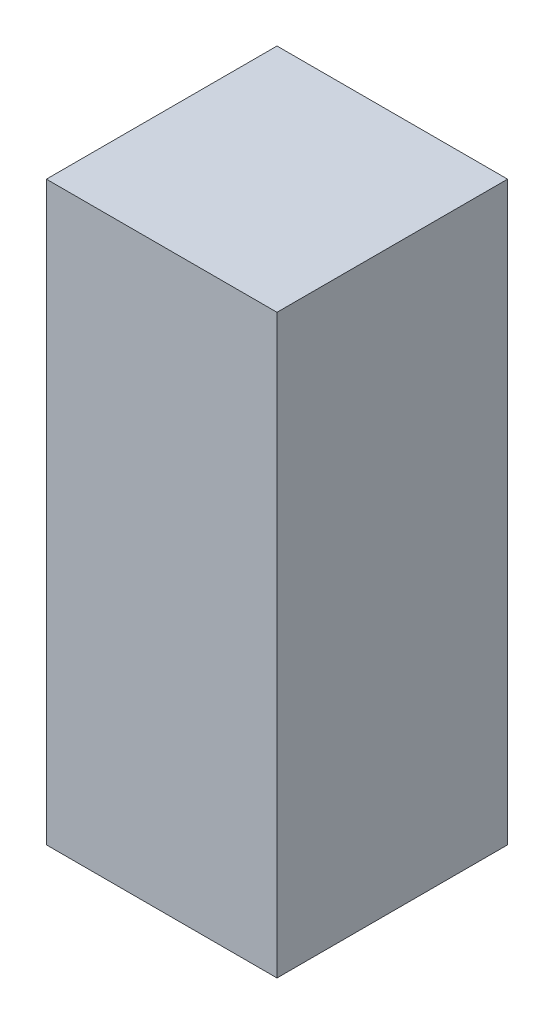
ISO-10303-21;
HEADER;
FILE_DESCRIPTION(('STEP AP214'),'2;1');
FILE_NAME('part.step','',(''),(''),'','','');
FILE_SCHEMA(('AUTOMOTIVE_DESIGN { 1 0 10303 214 1 1 1 1 }'));
ENDSEC;
DATA;
#1=APPLICATION_CONTEXT('core data for automotive mechanical design processes');
#2=APPLICATION_PROTOCOL_DEFINITION('international standard','automotive_design',2000,#1);
#3=PRODUCT_CONTEXT('',#1,'mechanical');
#4=PRODUCT('Part','Part','',(#3));
#5=PRODUCT_RELATED_PRODUCT_CATEGORY('part','',(#4));
#6=PRODUCT_DEFINITION_FORMATION('','',#4);
#7=PRODUCT_DEFINITION_CONTEXT('part definition',#1,'design');
#8=PRODUCT_DEFINITION('design','',#6,#7);
#9=PRODUCT_DEFINITION_SHAPE('','',#8);
#10=(LENGTH_UNIT() NAMED_UNIT(*) SI_UNIT(.MILLI.,.METRE.));
#11=(NAMED_UNIT(*) PLANE_ANGLE_UNIT() SI_UNIT($,.RADIAN.));
#12=(NAMED_UNIT(*) SI_UNIT($,.STERADIAN.) SOLID_ANGLE_UNIT());
#13=UNCERTAINTY_MEASURE_WITH_UNIT(LENGTH_MEASURE(1.E-05),#10,'distance_accuracy_value','');
#14=(GEOMETRIC_REPRESENTATION_CONTEXT(3) GLOBAL_UNCERTAINTY_ASSIGNED_CONTEXT((#13)) GLOBAL_UNIT_ASSIGNED_CONTEXT((#10,
#11,#12)) REPRESENTATION_CONTEXT('',''));
#15=CARTESIAN_POINT('',(0.,0.,0.));
#16=DIRECTION('',(0.,0.,1.));
#17=DIRECTION('',(1.,0.,0.));
#18=AXIS2_PLACEMENT_3D('',#15,#16,#17);
#19=CARTESIAN_POINT('',(-0.09999979999998,0.2499995,0.));
#20=DIRECTION('',(1.,0.,0.));
#21=DIRECTION('',(0.,0.,-1.));
#22=AXIS2_PLACEMENT_3D('',#19,#20,#21);
#23=PLANE('',#22);
#24=DIRECTION('',(0.,0.,1.));
#25=VECTOR('',#24,1.);
#26=CARTESIAN_POINT('',(-0.09999979999998,-0.2499995,0.));
#27=LINE('',#26,#25);
#28=CARTESIAN_POINT('',(-0.09999979999998,-0.2499995,0.));
#29=VERTEX_POINT('',#28);
#30=CARTESIAN_POINT('',(-0.09999979999998,-0.2499995,0.1999996));
#31=VERTEX_POINT('',#30);
#32=EDGE_CURVE('E20',#29,#31,#27,.T.);
#33=ORIENTED_EDGE('',*,*,#32,.T.);
#34=DIRECTION('',(0.,1.,0.));
#35=VECTOR('',#34,1.);
#36=CARTESIAN_POINT('',(-0.09999979999998,-0.2499995,0.1999996));
#37=LINE('',#36,#35);
#38=CARTESIAN_POINT('',(-0.09999979999998,0.2499995,0.1999996));
#39=VERTEX_POINT('',#38);
#40=EDGE_CURVE('E55',#31,#39,#37,.T.);
#41=ORIENTED_EDGE('',*,*,#40,.T.);
#42=DIRECTION('',(0.,0.,-1.));
#43=VECTOR('',#42,1.);
#44=CARTESIAN_POINT('',(-0.09999979999998,0.2499995,0.));
#45=LINE('',#44,#43);
#46=CARTESIAN_POINT('',(-0.09999979999998,0.2499995,0.));
#47=VERTEX_POINT('',#46);
#48=EDGE_CURVE('E74',#39,#47,#45,.T.);
#49=ORIENTED_EDGE('',*,*,#48,.T.);
#50=DIRECTION('',(0.,1.,0.));
#51=VECTOR('',#50,1.);
#52=CARTESIAN_POINT('',(-0.09999979999998,-0.2499995,0.));
#53=LINE('',#52,#51);
#54=EDGE_CURVE('E66',#29,#47,#53,.T.);
#55=ORIENTED_EDGE('',*,*,#54,.F.);
#56=EDGE_LOOP('',(#33,#41,#49,#55));
#57=FACE_BOUND('',#56,.T.);
#58=ADVANCED_FACE('F17',(#57),#23,.F.);
#59=CARTESIAN_POINT('',(-0.09999979999998,-0.2499995,0.));
#60=DIRECTION('',(0.,1.,0.));
#61=DIRECTION('',(0.,0.,1.));
#62=AXIS2_PLACEMENT_3D('',#59,#60,#61);
#63=PLANE('',#62);
#64=DIRECTION('',(0.,0.,1.));
#65=VECTOR('',#64,1.);
#66=CARTESIAN_POINT('',(0.09999980000001,-0.2499995,0.));
#67=LINE('',#66,#65);
#68=CARTESIAN_POINT('',(0.09999980000001,-0.2499995,0.));
#69=VERTEX_POINT('',#68);
#70=CARTESIAN_POINT('',(0.09999980000001,-0.2499995,0.1999996));
#71=VERTEX_POINT('',#70);
#72=EDGE_CURVE('E72',#69,#71,#67,.T.);
#73=ORIENTED_EDGE('',*,*,#72,.T.);
#74=DIRECTION('',(-1.,0.,0.));
#75=VECTOR('',#74,1.);
#76=CARTESIAN_POINT('',(-0.09999979999998,-0.2499995,0.1999996));
#77=LINE('',#76,#75);
#78=EDGE_CURVE('E62',#71,#31,#77,.T.);
#79=ORIENTED_EDGE('',*,*,#78,.T.);
#80=ORIENTED_EDGE('',*,*,#32,.F.);
#81=DIRECTION('',(-1.,0.,0.));
#82=VECTOR('',#81,1.);
#83=CARTESIAN_POINT('',(-0.09999979999998,-0.2499995,0.));
#84=LINE('',#83,#82);
#85=EDGE_CURVE('E80',#69,#29,#84,.T.);
#86=ORIENTED_EDGE('',*,*,#85,.F.);
#87=EDGE_LOOP('',(#73,#79,#80,#86));
#88=FACE_BOUND('',#87,.T.);
#89=ADVANCED_FACE('F71',(#88),#63,.F.);
#90=CARTESIAN_POINT('',(-0.09999979999998,-0.2499995,0.1999996));
#91=DIRECTION('',(0.,0.,-1.));
#92=DIRECTION('',(-1.,0.,0.));
#93=AXIS2_PLACEMENT_3D('',#90,#91,#92);
#94=PLANE('',#93);
#95=DIRECTION('',(0.,1.,0.));
#96=VECTOR('',#95,1.);
#97=CARTESIAN_POINT('',(0.09999980000001,-0.2499995,0.1999996));
#98=LINE('',#97,#96);
#99=CARTESIAN_POINT('',(0.09999980000001,0.2499995,0.1999996));
#100=VERTEX_POINT('',#99);
#101=EDGE_CURVE('E83',#71,#100,#98,.T.);
#102=ORIENTED_EDGE('',*,*,#101,.T.);
#103=DIRECTION('',(1.,0.,0.));
#104=VECTOR('',#103,1.);
#105=CARTESIAN_POINT('',(0.09999980000001,0.2499995,0.1999996));
#106=LINE('',#105,#104);
#107=EDGE_CURVE('E64',#100,#39,#106,.F.);
#108=ORIENTED_EDGE('',*,*,#107,.T.);
#109=ORIENTED_EDGE('',*,*,#40,.F.);
#110=ORIENTED_EDGE('',*,*,#78,.F.);
#111=EDGE_LOOP('',(#102,#108,#109,#110));
#112=FACE_BOUND('',#111,.T.);
#113=ADVANCED_FACE('F60',(#112),#94,.F.);
#114=CARTESIAN_POINT('',(0.09999980000001,0.2499995,0.));
#115=DIRECTION('',(0.,-1.,0.));
#116=DIRECTION('',(0.,0.,-1.));
#117=AXIS2_PLACEMENT_3D('',#114,#115,#116);
#118=PLANE('',#117);
#119=ORIENTED_EDGE('',*,*,#48,.F.);
#120=ORIENTED_EDGE('',*,*,#107,.F.);
#121=DIRECTION('',(0.,0.,1.));
#122=VECTOR('',#121,1.);
#123=CARTESIAN_POINT('',(0.09999980000001,0.2499995,0.));
#124=LINE('',#123,#122);
#125=CARTESIAN_POINT('',(0.09999980000001,0.2499995,0.));
#126=VERTEX_POINT('',#125);
#127=EDGE_CURVE('E26',#100,#126,#124,.F.);
#128=ORIENTED_EDGE('',*,*,#127,.T.);
#129=DIRECTION('',(-1.,0.,0.));
#130=VECTOR('',#129,1.);
#131=CARTESIAN_POINT('',(-0.09999979999998,0.2499995,0.));
#132=LINE('',#131,#130);
#133=EDGE_CURVE('E34',#47,#126,#132,.F.);
#134=ORIENTED_EDGE('',*,*,#133,.F.);
#135=EDGE_LOOP('',(#119,#120,#128,#134));
#136=FACE_BOUND('',#135,.T.);
#137=ADVANCED_FACE('F88',(#136),#118,.F.);
#138=CARTESIAN_POINT('',(-0.09999979999998,-0.2499995,0.));
#139=DIRECTION('',(0.,0.,-1.));
#140=DIRECTION('',(-1.,0.,0.));
#141=AXIS2_PLACEMENT_3D('',#138,#139,#140);
#142=PLANE('',#141);
#143=DIRECTION('',(0.,1.,0.));
#144=VECTOR('',#143,1.);
#145=CARTESIAN_POINT('',(0.09999980000001,-0.2499995,0.));
#146=LINE('',#145,#144);
#147=EDGE_CURVE('E11',#126,#69,#146,.F.);
#148=ORIENTED_EDGE('',*,*,#147,.T.);
#149=ORIENTED_EDGE('',*,*,#85,.T.);
#150=ORIENTED_EDGE('',*,*,#54,.T.);
#151=ORIENTED_EDGE('',*,*,#133,.T.);
#152=EDGE_LOOP('',(#148,#149,#150,#151));
#153=FACE_BOUND('',#152,.T.);
#154=ADVANCED_FACE('F91',(#153),#142,.T.);
#155=CARTESIAN_POINT('',(0.09999980000001,-0.2499995,0.));
#156=DIRECTION('',(-1.,0.,0.));
#157=DIRECTION('',(0.,0.,1.));
#158=AXIS2_PLACEMENT_3D('',#155,#156,#157);
#159=PLANE('',#158);
#160=ORIENTED_EDGE('',*,*,#127,.F.);
#161=ORIENTED_EDGE('',*,*,#101,.F.);
#162=ORIENTED_EDGE('',*,*,#72,.F.);
#163=ORIENTED_EDGE('',*,*,#147,.F.);
#164=EDGE_LOOP('',(#160,#161,#162,#163));
#165=FACE_BOUND('',#164,.T.);
#166=ADVANCED_FACE('F90',(#165),#159,.F.);
#167=CLOSED_SHELL('',(#58,#89,#113,#137,#154,#166));
#168=MANIFOLD_SOLID_BREP('B1',#167);
#169=ADVANCED_BREP_SHAPE_REPRESENTATION('',(#18,#168),#14);
#170=SHAPE_DEFINITION_REPRESENTATION(#9,#169);
ENDSEC;
END-ISO-10303-21;
